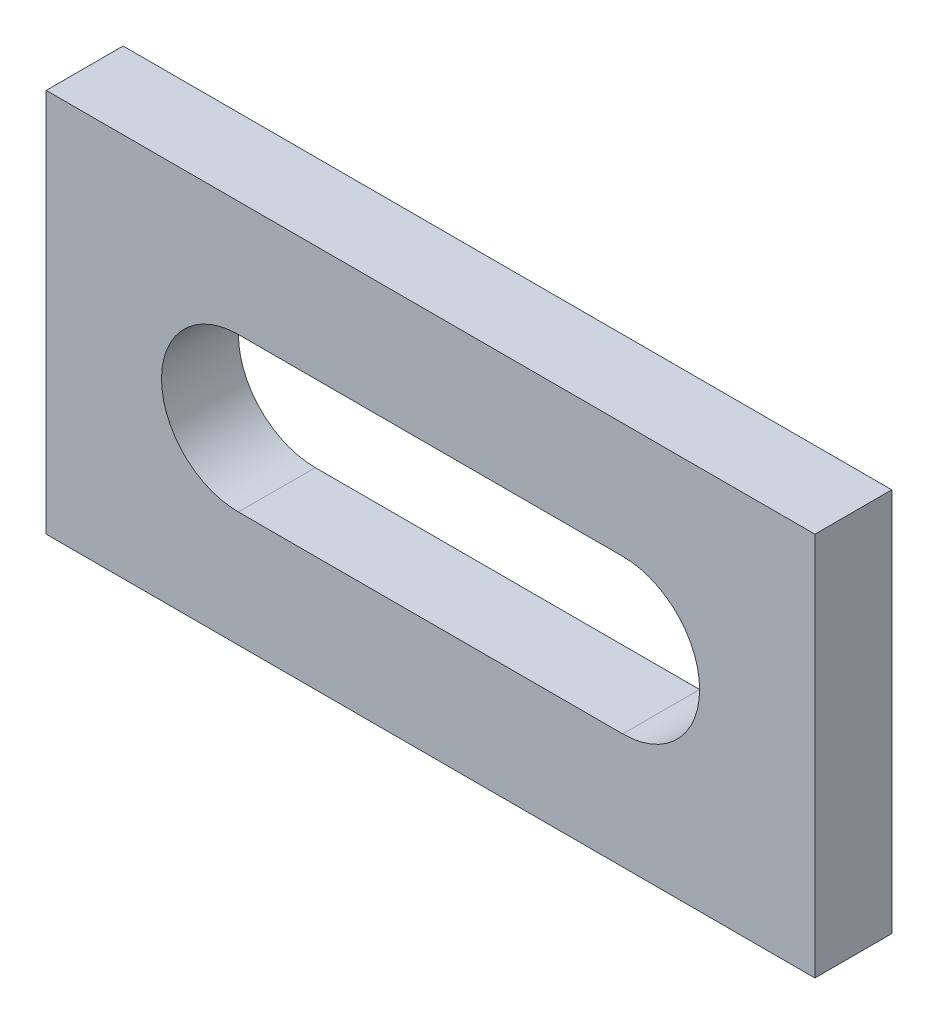
ISO-10303-21;
HEADER;
FILE_DESCRIPTION(('STEP AP214'),'2;1');
FILE_NAME('part.step','',(''),(''),'','','');
FILE_SCHEMA(('AUTOMOTIVE_DESIGN { 1 0 10303 214 1 1 1 1 }'));
ENDSEC;
DATA;
#1=APPLICATION_CONTEXT('core data for automotive mechanical design processes');
#2=APPLICATION_PROTOCOL_DEFINITION('international standard','automotive_design',2000,#1);
#3=PRODUCT_CONTEXT('',#1,'mechanical');
#4=PRODUCT('Part','Part','',(#3));
#5=PRODUCT_RELATED_PRODUCT_CATEGORY('part','',(#4));
#6=PRODUCT_DEFINITION_FORMATION('','',#4);
#7=PRODUCT_DEFINITION_CONTEXT('part definition',#1,'design');
#8=PRODUCT_DEFINITION('design','',#6,#7);
#9=PRODUCT_DEFINITION_SHAPE('','',#8);
#10=(LENGTH_UNIT() NAMED_UNIT(*) SI_UNIT(.MILLI.,.METRE.));
#11=(NAMED_UNIT(*) PLANE_ANGLE_UNIT() SI_UNIT($,.RADIAN.));
#12=(NAMED_UNIT(*) SI_UNIT($,.STERADIAN.) SOLID_ANGLE_UNIT());
#13=UNCERTAINTY_MEASURE_WITH_UNIT(LENGTH_MEASURE(1.E-05),#10,'distance_accuracy_value','');
#14=(GEOMETRIC_REPRESENTATION_CONTEXT(3) GLOBAL_UNCERTAINTY_ASSIGNED_CONTEXT((#13)) GLOBAL_UNIT_ASSIGNED_CONTEXT((#10,
#11,#12)) REPRESENTATION_CONTEXT('',''));
#15=CARTESIAN_POINT('',(0.,0.,0.));
#16=DIRECTION('',(0.,0.,1.));
#17=DIRECTION('',(1.,0.,0.));
#18=AXIS2_PLACEMENT_3D('',#15,#16,#17);
#19=CARTESIAN_POINT('',(50.,-25.,5.));
#20=DIRECTION('',(-1.,0.,0.));
#21=DIRECTION('',(0.,0.,1.));
#22=AXIS2_PLACEMENT_3D('',#19,#20,#21);
#23=PLANE('',#22);
#24=DIRECTION('',(0.,1.,0.));
#25=VECTOR('',#24,1.);
#26=CARTESIAN_POINT('',(50.,-25.,-5.));
#27=LINE('',#26,#25);
#28=CARTESIAN_POINT('',(50.,-25.,-5.));
#29=VERTEX_POINT('',#28);
#30=CARTESIAN_POINT('',(50.,25.,-5.));
#31=VERTEX_POINT('',#30);
#32=EDGE_CURVE('E131',#29,#31,#27,.T.);
#33=ORIENTED_EDGE('',*,*,#32,.T.);
#34=DIRECTION('',(0.,0.,-1.));
#35=VECTOR('',#34,1.);
#36=CARTESIAN_POINT('',(50.,25.,5.));
#37=LINE('',#36,#35);
#38=CARTESIAN_POINT('',(50.,25.,5.));
#39=VERTEX_POINT('',#38);
#40=EDGE_CURVE('E11',#39,#31,#37,.T.);
#41=ORIENTED_EDGE('',*,*,#40,.F.);
#42=DIRECTION('',(0.,1.,0.));
#43=VECTOR('',#42,1.);
#44=CARTESIAN_POINT('',(50.,-25.,5.));
#45=LINE('',#44,#43);
#46=CARTESIAN_POINT('',(50.,-25.,5.));
#47=VERTEX_POINT('',#46);
#48=EDGE_CURVE('E134',#47,#39,#45,.T.);
#49=ORIENTED_EDGE('',*,*,#48,.F.);
#50=DIRECTION('',(0.,0.,-1.));
#51=VECTOR('',#50,1.);
#52=CARTESIAN_POINT('',(50.,-25.,5.));
#53=LINE('',#52,#51);
#54=EDGE_CURVE('E144',#47,#29,#53,.T.);
#55=ORIENTED_EDGE('',*,*,#54,.T.);
#56=EDGE_LOOP('',(#33,#41,#49,#55));
#57=FACE_BOUND('',#56,.T.);
#58=ADVANCED_FACE('F33',(#57),#23,.F.);
#59=CARTESIAN_POINT('',(-50.,25.,5.));
#60=DIRECTION('',(0.,-1.,0.));
#61=DIRECTION('',(0.,0.,-1.));
#62=AXIS2_PLACEMENT_3D('',#59,#60,#61);
#63=PLANE('',#62);
#64=DIRECTION('',(-1.,0.,0.));
#65=VECTOR('',#64,1.);
#66=CARTESIAN_POINT('',(-50.,25.,-5.));
#67=LINE('',#66,#65);
#68=CARTESIAN_POINT('',(-50.,25.,-5.));
#69=VERTEX_POINT('',#68);
#70=EDGE_CURVE('E147',#31,#69,#67,.T.);
#71=ORIENTED_EDGE('',*,*,#70,.T.);
#72=DIRECTION('',(0.,0.,-1.));
#73=VECTOR('',#72,1.);
#74=CARTESIAN_POINT('',(-50.,25.,5.));
#75=LINE('',#74,#73);
#76=CARTESIAN_POINT('',(-50.,25.,5.));
#77=VERTEX_POINT('',#76);
#78=EDGE_CURVE('E40',#77,#69,#75,.T.);
#79=ORIENTED_EDGE('',*,*,#78,.F.);
#80=DIRECTION('',(-1.,0.,0.));
#81=VECTOR('',#80,1.);
#82=CARTESIAN_POINT('',(-50.,25.,5.));
#83=LINE('',#82,#81);
#84=EDGE_CURVE('E137',#39,#77,#83,.T.);
#85=ORIENTED_EDGE('',*,*,#84,.F.);
#86=ORIENTED_EDGE('',*,*,#40,.T.);
#87=EDGE_LOOP('',(#71,#79,#85,#86));
#88=FACE_BOUND('',#87,.T.);
#89=ADVANCED_FACE('F175',(#88),#63,.F.);
#90=CARTESIAN_POINT('',(-50.,-25.,5.));
#91=DIRECTION('',(1.,0.,0.));
#92=DIRECTION('',(0.,0.,-1.));
#93=AXIS2_PLACEMENT_3D('',#90,#91,#92);
#94=PLANE('',#93);
#95=DIRECTION('',(0.,-1.,0.));
#96=VECTOR('',#95,1.);
#97=CARTESIAN_POINT('',(-50.,-25.,-5.));
#98=LINE('',#97,#96);
#99=CARTESIAN_POINT('',(-50.,-25.,-5.));
#100=VERTEX_POINT('',#99);
#101=EDGE_CURVE('E149',#69,#100,#98,.T.);
#102=ORIENTED_EDGE('',*,*,#101,.T.);
#103=DIRECTION('',(0.,0.,-1.));
#104=VECTOR('',#103,1.);
#105=CARTESIAN_POINT('',(-50.,-25.,5.));
#106=LINE('',#105,#104);
#107=CARTESIAN_POINT('',(-50.,-25.,5.));
#108=VERTEX_POINT('',#107);
#109=EDGE_CURVE('E154',#108,#100,#106,.T.);
#110=ORIENTED_EDGE('',*,*,#109,.F.);
#111=DIRECTION('',(0.,-1.,0.));
#112=VECTOR('',#111,1.);
#113=CARTESIAN_POINT('',(-50.,-25.,5.));
#114=LINE('',#113,#112);
#115=EDGE_CURVE('E140',#77,#108,#114,.T.);
#116=ORIENTED_EDGE('',*,*,#115,.F.);
#117=ORIENTED_EDGE('',*,*,#78,.T.);
#118=EDGE_LOOP('',(#102,#110,#116,#117));
#119=FACE_BOUND('',#118,.T.);
#120=ADVANCED_FACE('F161',(#119),#94,.F.);
#121=CARTESIAN_POINT('',(-50.,-25.,5.));
#122=DIRECTION('',(0.,1.,0.));
#123=DIRECTION('',(0.,0.,1.));
#124=AXIS2_PLACEMENT_3D('',#121,#122,#123);
#125=PLANE('',#124);
#126=DIRECTION('',(1.,0.,0.));
#127=VECTOR('',#126,1.);
#128=CARTESIAN_POINT('',(-50.,-25.,-5.));
#129=LINE('',#128,#127);
#130=EDGE_CURVE('E138',#100,#29,#129,.T.);
#131=ORIENTED_EDGE('',*,*,#130,.T.);
#132=ORIENTED_EDGE('',*,*,#54,.F.);
#133=DIRECTION('',(1.,0.,0.));
#134=VECTOR('',#133,1.);
#135=CARTESIAN_POINT('',(-50.,-25.,5.));
#136=LINE('',#135,#134);
#137=EDGE_CURVE('E142',#108,#47,#136,.T.);
#138=ORIENTED_EDGE('',*,*,#137,.F.);
#139=ORIENTED_EDGE('',*,*,#109,.T.);
#140=EDGE_LOOP('',(#131,#132,#138,#139));
#141=FACE_BOUND('',#140,.T.);
#142=ADVANCED_FACE('F170',(#141),#125,.F.);
#143=CARTESIAN_POINT('',(0.,0.,5.));
#144=DIRECTION('',(0.,0.,-1.));
#145=DIRECTION('',(-1.,0.,0.));
#146=AXIS2_PLACEMENT_3D('',#143,#144,#145);
#147=PLANE('',#146);
#148=DIRECTION('',(1.,0.,0.));
#149=VECTOR('',#148,1.);
#150=CARTESIAN_POINT('',(-25.,-10.,5.));
#151=LINE('',#150,#149);
#152=CARTESIAN_POINT('',(-25.,-10.,5.));
#153=VERTEX_POINT('',#152);
#154=CARTESIAN_POINT('',(25.,-9.99999999999999,5.));
#155=VERTEX_POINT('',#154);
#156=EDGE_CURVE('E108',#153,#155,#151,.T.);
#157=ORIENTED_EDGE('',*,*,#156,.F.);
#158=CARTESIAN_POINT('',(-25.,0.,5.));
#159=DIRECTION('',(0.,0.,1.));
#160=DIRECTION('',(1.,0.,0.));
#161=AXIS2_PLACEMENT_3D('',#158,#159,#160);
#162=CIRCLE('',#161,10.);
#163=CARTESIAN_POINT('',(-25.,10.,5.));
#164=VERTEX_POINT('',#163);
#165=EDGE_CURVE('E47',#164,#153,#162,.T.);
#166=ORIENTED_EDGE('',*,*,#165,.F.);
#167=DIRECTION('',(-1.,0.,0.));
#168=VECTOR('',#167,1.);
#169=CARTESIAN_POINT('',(-25.,10.,5.));
#170=LINE('',#169,#168);
#171=CARTESIAN_POINT('',(25.,10.,5.));
#172=VERTEX_POINT('',#171);
#173=EDGE_CURVE('E115',#172,#164,#170,.T.);
#174=ORIENTED_EDGE('',*,*,#173,.F.);
#175=CARTESIAN_POINT('',(25.,0.,5.));
#176=DIRECTION('',(0.,0.,1.));
#177=DIRECTION('',(1.,0.,0.));
#178=AXIS2_PLACEMENT_3D('',#175,#176,#177);
#179=CIRCLE('',#178,10.);
#180=EDGE_CURVE('E99',#155,#172,#179,.T.);
#181=ORIENTED_EDGE('',*,*,#180,.F.);
#182=EDGE_LOOP('',(#157,#166,#174,#181));
#183=FACE_BOUND('',#182,.T.);
#184=ORIENTED_EDGE('',*,*,#48,.T.);
#185=ORIENTED_EDGE('',*,*,#84,.T.);
#186=ORIENTED_EDGE('',*,*,#115,.T.);
#187=ORIENTED_EDGE('',*,*,#137,.T.);
#188=EDGE_LOOP('',(#184,#185,#186,#187));
#189=FACE_BOUND('',#188,.T.);
#190=ADVANCED_FACE('F112',(#183,#189),#147,.F.);
#191=CARTESIAN_POINT('',(0.,0.,-5.));
#192=DIRECTION('',(0.,0.,-1.));
#193=DIRECTION('',(-1.,0.,0.));
#194=AXIS2_PLACEMENT_3D('',#191,#192,#193);
#195=PLANE('',#194);
#196=CARTESIAN_POINT('',(-25.,0.,-5.));
#197=DIRECTION('',(0.,0.,1.));
#198=DIRECTION('',(1.,0.,0.));
#199=AXIS2_PLACEMENT_3D('',#196,#197,#198);
#200=CIRCLE('',#199,10.);
#201=CARTESIAN_POINT('',(-25.,10.,-5.));
#202=VERTEX_POINT('',#201);
#203=CARTESIAN_POINT('',(-25.,-10.,-5.));
#204=VERTEX_POINT('',#203);
#205=EDGE_CURVE('E117',#202,#204,#200,.T.);
#206=ORIENTED_EDGE('',*,*,#205,.T.);
#207=DIRECTION('',(1.,0.,0.));
#208=VECTOR('',#207,1.);
#209=CARTESIAN_POINT('',(-25.,-10.,-5.));
#210=LINE('',#209,#208);
#211=CARTESIAN_POINT('',(25.,-9.99999999999999,-5.));
#212=VERTEX_POINT('',#211);
#213=EDGE_CURVE('E123',#204,#212,#210,.T.);
#214=ORIENTED_EDGE('',*,*,#213,.T.);
#215=CARTESIAN_POINT('',(25.,0.,-5.));
#216=DIRECTION('',(0.,0.,1.));
#217=DIRECTION('',(1.,0.,0.));
#218=AXIS2_PLACEMENT_3D('',#215,#216,#217);
#219=CIRCLE('',#218,10.);
#220=CARTESIAN_POINT('',(25.,10.,-5.));
#221=VERTEX_POINT('',#220);
#222=EDGE_CURVE('E55',#212,#221,#219,.T.);
#223=ORIENTED_EDGE('',*,*,#222,.T.);
#224=DIRECTION('',(-1.,0.,0.));
#225=VECTOR('',#224,1.);
#226=CARTESIAN_POINT('',(-25.,10.,-5.));
#227=LINE('',#226,#225);
#228=EDGE_CURVE('E126',#221,#202,#227,.T.);
#229=ORIENTED_EDGE('',*,*,#228,.T.);
#230=EDGE_LOOP('',(#206,#214,#223,#229));
#231=FACE_BOUND('',#230,.T.);
#232=ORIENTED_EDGE('',*,*,#32,.F.);
#233=ORIENTED_EDGE('',*,*,#130,.F.);
#234=ORIENTED_EDGE('',*,*,#101,.F.);
#235=ORIENTED_EDGE('',*,*,#70,.F.);
#236=EDGE_LOOP('',(#232,#233,#234,#235));
#237=FACE_BOUND('',#236,.T.);
#238=ADVANCED_FACE('F167',(#231,#237),#195,.T.);
#239=CARTESIAN_POINT('',(-25.,0.,-5.));
#240=DIRECTION('',(0.,0.,1.));
#241=DIRECTION('',(1.,0.,0.));
#242=AXIS2_PLACEMENT_3D('',#239,#240,#241);
#243=CYLINDRICAL_SURFACE('',#242,10.);
#244=DIRECTION('',(0.,0.,1.));
#245=VECTOR('',#244,1.);
#246=CARTESIAN_POINT('',(-25.,-10.,-5.));
#247=LINE('',#246,#245);
#248=EDGE_CURVE('E105',#204,#153,#247,.T.);
#249=ORIENTED_EDGE('',*,*,#248,.F.);
#250=ORIENTED_EDGE('',*,*,#205,.F.);
#251=DIRECTION('',(0.,0.,1.));
#252=VECTOR('',#251,1.);
#253=CARTESIAN_POINT('',(-25.,10.,-5.));
#254=LINE('',#253,#252);
#255=EDGE_CURVE('E129',#202,#164,#254,.T.);
#256=ORIENTED_EDGE('',*,*,#255,.T.);
#257=ORIENTED_EDGE('',*,*,#165,.T.);
#258=EDGE_LOOP('',(#249,#250,#256,#257));
#259=FACE_BOUND('',#258,.T.);
#260=ADVANCED_FACE('F187',(#259),#243,.F.);
#261=CARTESIAN_POINT('',(-25.,10.,-5.));
#262=DIRECTION('',(0.,1.,0.));
#263=DIRECTION('',(-1.,0.,0.));
#264=AXIS2_PLACEMENT_3D('',#261,#262,#263);
#265=PLANE('',#264);
#266=ORIENTED_EDGE('',*,*,#255,.F.);
#267=ORIENTED_EDGE('',*,*,#228,.F.);
#268=DIRECTION('',(0.,0.,1.));
#269=VECTOR('',#268,1.);
#270=CARTESIAN_POINT('',(25.,10.,-5.));
#271=LINE('',#270,#269);
#272=EDGE_CURVE('E104',#221,#172,#271,.T.);
#273=ORIENTED_EDGE('',*,*,#272,.T.);
#274=ORIENTED_EDGE('',*,*,#173,.T.);
#275=EDGE_LOOP('',(#266,#267,#273,#274));
#276=FACE_BOUND('',#275,.T.);
#277=ADVANCED_FACE('F193',(#276),#265,.F.);
#278=CARTESIAN_POINT('',(25.,0.,-5.));
#279=DIRECTION('',(0.,0.,1.));
#280=DIRECTION('',(1.,0.,0.));
#281=AXIS2_PLACEMENT_3D('',#278,#279,#280);
#282=CYLINDRICAL_SURFACE('',#281,10.);
#283=ORIENTED_EDGE('',*,*,#272,.F.);
#284=ORIENTED_EDGE('',*,*,#222,.F.);
#285=DIRECTION('',(0.,0.,1.));
#286=VECTOR('',#285,1.);
#287=CARTESIAN_POINT('',(25.,-9.99999999999999,-5.));
#288=LINE('',#287,#286);
#289=EDGE_CURVE('E95',#212,#155,#288,.T.);
#290=ORIENTED_EDGE('',*,*,#289,.T.);
#291=ORIENTED_EDGE('',*,*,#180,.T.);
#292=EDGE_LOOP('',(#283,#284,#290,#291));
#293=FACE_BOUND('',#292,.T.);
#294=ADVANCED_FACE('F97',(#293),#282,.F.);
#295=CARTESIAN_POINT('',(-25.,-10.,-5.));
#296=DIRECTION('',(0.,-1.,0.));
#297=DIRECTION('',(1.,0.,0.));
#298=AXIS2_PLACEMENT_3D('',#295,#296,#297);
#299=PLANE('',#298);
#300=ORIENTED_EDGE('',*,*,#289,.F.);
#301=ORIENTED_EDGE('',*,*,#213,.F.);
#302=ORIENTED_EDGE('',*,*,#248,.T.);
#303=ORIENTED_EDGE('',*,*,#156,.T.);
#304=EDGE_LOOP('',(#300,#301,#302,#303));
#305=FACE_BOUND('',#304,.T.);
#306=ADVANCED_FACE('F109',(#305),#299,.F.);
#307=CLOSED_SHELL('',(#58,#89,#120,#142,#190,#238,#260,#277,#294,#306));
#308=MANIFOLD_SOLID_BREP('B2',#307);
#309=ADVANCED_BREP_SHAPE_REPRESENTATION('',(#18,#308),#14);
#310=SHAPE_DEFINITION_REPRESENTATION(#9,#309);
ENDSEC;
END-ISO-10303-21;
